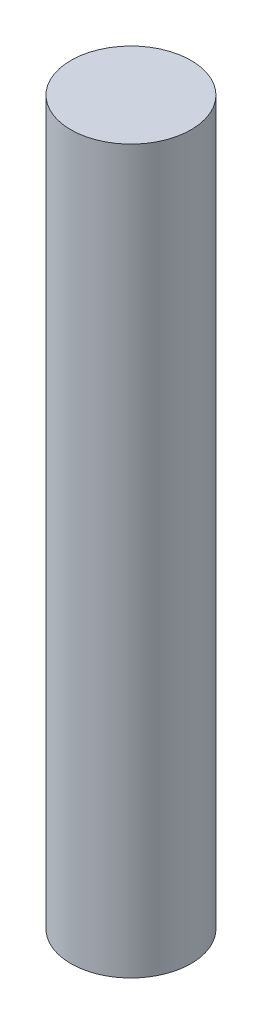
ISO-10303-21;
HEADER;
FILE_DESCRIPTION(('STEP AP214'),'2;1');
FILE_NAME('part.step','',(''),(''),'','','');
FILE_SCHEMA(('AUTOMOTIVE_DESIGN { 1 0 10303 214 1 1 1 1 }'));
ENDSEC;
DATA;
#1=APPLICATION_CONTEXT('core data for automotive mechanical design processes');
#2=APPLICATION_PROTOCOL_DEFINITION('international standard','automotive_design',2000,#1);
#3=PRODUCT_CONTEXT('',#1,'mechanical');
#4=PRODUCT('Part','Part','',(#3));
#5=PRODUCT_RELATED_PRODUCT_CATEGORY('part','',(#4));
#6=PRODUCT_DEFINITION_FORMATION('','',#4);
#7=PRODUCT_DEFINITION_CONTEXT('part definition',#1,'design');
#8=PRODUCT_DEFINITION('design','',#6,#7);
#9=PRODUCT_DEFINITION_SHAPE('','',#8);
#10=(LENGTH_UNIT() NAMED_UNIT(*) SI_UNIT(.MILLI.,.METRE.));
#11=(NAMED_UNIT(*) PLANE_ANGLE_UNIT() SI_UNIT($,.RADIAN.));
#12=(NAMED_UNIT(*) SI_UNIT($,.STERADIAN.) SOLID_ANGLE_UNIT());
#13=UNCERTAINTY_MEASURE_WITH_UNIT(LENGTH_MEASURE(1.E-05),#10,'distance_accuracy_value','');
#14=(GEOMETRIC_REPRESENTATION_CONTEXT(3) GLOBAL_UNCERTAINTY_ASSIGNED_CONTEXT((#13)) GLOBAL_UNIT_ASSIGNED_CONTEXT((#10,
#11,#12)) REPRESENTATION_CONTEXT('',''));
#15=CARTESIAN_POINT('',(0.,0.,0.));
#16=DIRECTION('',(0.,0.,1.));
#17=DIRECTION('',(1.,0.,0.));
#18=AXIS2_PLACEMENT_3D('',#15,#16,#17);
#19=CARTESIAN_POINT('',(0.,76.17,0.));
#20=DIRECTION('',(0.,-1.,0.));
#21=DIRECTION('',(0.,0.,-1.));
#22=AXIS2_PLACEMENT_3D('',#19,#20,#21);
#23=CYLINDRICAL_SURFACE('',#22,6.34);
#24=CARTESIAN_POINT('',(0.,76.17,0.));
#25=DIRECTION('',(0.,1.,0.));
#26=DIRECTION('',(0.,0.,1.));
#27=AXIS2_PLACEMENT_3D('',#24,#25,#26);
#28=CIRCLE('',#27,6.34);
#29=CARTESIAN_POINT('',(0.,76.17,6.34));
#30=VERTEX_POINT('',#29);
#31=EDGE_CURVE('E10',#30,#30,#28,.T.);
#32=ORIENTED_EDGE('',*,*,#31,.F.);
#33=EDGE_LOOP('',(#32));
#34=FACE_BOUND('',#33,.T.);
#35=CARTESIAN_POINT('',(0.,0.,0.));
#36=DIRECTION('',(0.,1.,0.));
#37=DIRECTION('',(0.,0.,1.));
#38=AXIS2_PLACEMENT_3D('',#35,#36,#37);
#39=CIRCLE('',#38,6.34);
#40=CARTESIAN_POINT('',(0.,0.,6.34));
#41=VERTEX_POINT('',#40);
#42=EDGE_CURVE('E35',#41,#41,#39,.T.);
#43=ORIENTED_EDGE('',*,*,#42,.T.);
#44=EDGE_LOOP('',(#43));
#45=FACE_BOUND('',#44,.T.);
#46=ADVANCED_FACE('F32',(#34,#45),#23,.T.);
#47=CARTESIAN_POINT('',(0.,76.17,0.));
#48=DIRECTION('',(0.,1.,0.));
#49=DIRECTION('',(0.,0.,1.));
#50=AXIS2_PLACEMENT_3D('',#47,#48,#49);
#51=PLANE('',#50);
#52=ORIENTED_EDGE('',*,*,#31,.T.);
#53=EDGE_LOOP('',(#52));
#54=FACE_BOUND('',#53,.T.);
#55=ADVANCED_FACE('F47',(#54),#51,.T.);
#56=CARTESIAN_POINT('',(0.,0.,0.));
#57=DIRECTION('',(0.,1.,0.));
#58=DIRECTION('',(0.,0.,1.));
#59=AXIS2_PLACEMENT_3D('',#56,#57,#58);
#60=PLANE('',#59);
#61=ORIENTED_EDGE('',*,*,#42,.F.);
#62=EDGE_LOOP('',(#61));
#63=FACE_BOUND('',#62,.T.);
#64=ADVANCED_FACE('F45',(#63),#60,.F.);
#65=CLOSED_SHELL('',(#46,#55,#64));
#66=MANIFOLD_SOLID_BREP('B2',#65);
#67=ADVANCED_BREP_SHAPE_REPRESENTATION('',(#18,#66),#14);
#68=SHAPE_DEFINITION_REPRESENTATION(#9,#67);
ENDSEC;
END-ISO-10303-21;
